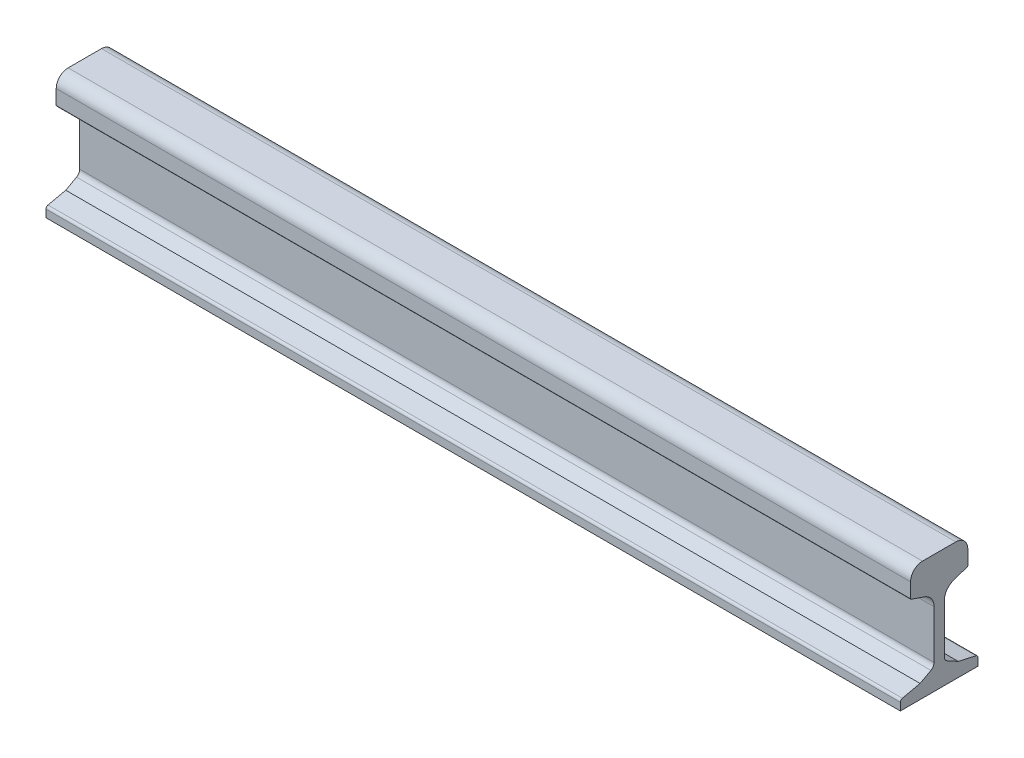
ISO-10303-21;
HEADER;
FILE_DESCRIPTION(('STEP AP214'),'2;1');
FILE_NAME('part.step','',(''),(''),'','','');
FILE_SCHEMA(('AUTOMOTIVE_DESIGN { 1 0 10303 214 1 1 1 1 }'));
ENDSEC;
DATA;
#1=APPLICATION_CONTEXT('core data for automotive mechanical design processes');
#2=APPLICATION_PROTOCOL_DEFINITION('international standard','automotive_design',2000,#1);
#3=PRODUCT_CONTEXT('',#1,'mechanical');
#4=PRODUCT('Part','Part','',(#3));
#5=PRODUCT_RELATED_PRODUCT_CATEGORY('part','',(#4));
#6=PRODUCT_DEFINITION_FORMATION('','',#4);
#7=PRODUCT_DEFINITION_CONTEXT('part definition',#1,'design');
#8=PRODUCT_DEFINITION('design','',#6,#7);
#9=PRODUCT_DEFINITION_SHAPE('','',#8);
#10=(LENGTH_UNIT() NAMED_UNIT(*) SI_UNIT(.MILLI.,.METRE.));
#11=(NAMED_UNIT(*) PLANE_ANGLE_UNIT() SI_UNIT($,.RADIAN.));
#12=(NAMED_UNIT(*) SI_UNIT($,.STERADIAN.) SOLID_ANGLE_UNIT());
#13=UNCERTAINTY_MEASURE_WITH_UNIT(LENGTH_MEASURE(1.E-05),#10,'distance_accuracy_value','');
#14=(GEOMETRIC_REPRESENTATION_CONTEXT(3) GLOBAL_UNCERTAINTY_ASSIGNED_CONTEXT((#13)) GLOBAL_UNIT_ASSIGNED_CONTEXT((#10,
#11,#12)) REPRESENTATION_CONTEXT('',''));
#15=CARTESIAN_POINT('',(0.,0.,0.));
#16=DIRECTION('',(0.,0.,1.));
#17=DIRECTION('',(1.,0.,0.));
#18=AXIS2_PLACEMENT_3D('',#15,#16,#17);
#19=CARTESIAN_POINT('',(500.,124.,19.5));
#20=DIRECTION('',(-1.,0.,0.));
#21=DIRECTION('',(0.,0.,1.));
#22=AXIS2_PLACEMENT_3D('',#19,#20,#21);
#23=CYLINDRICAL_SURFACE('',#22,14.);
#24=CARTESIAN_POINT('',(-500.,124.,19.5));
#25=DIRECTION('',(1.,0.,0.));
#26=DIRECTION('',(0.,0.,1.));
#27=AXIS2_PLACEMENT_3D('',#24,#25,#26);
#28=CIRCLE('',#27,14.);
#29=CARTESIAN_POINT('',(-500.,138.,19.5));
#30=VERTEX_POINT('',#29);
#31=CARTESIAN_POINT('',(-500.,124.,33.5));
#32=VERTEX_POINT('',#31);
#33=EDGE_CURVE('E229',#30,#32,#28,.T.);
#34=ORIENTED_EDGE('',*,*,#33,.T.);
#35=DIRECTION('',(-1.,0.,0.));
#36=VECTOR('',#35,1.);
#37=CARTESIAN_POINT('',(500.,124.,33.5));
#38=LINE('',#37,#36);
#39=CARTESIAN_POINT('',(500.,124.,33.5));
#40=VERTEX_POINT('',#39);
#41=EDGE_CURVE('E11',#40,#32,#38,.T.);
#42=ORIENTED_EDGE('',*,*,#41,.F.);
#43=CARTESIAN_POINT('',(500.,124.,19.5));
#44=DIRECTION('',(1.,0.,0.));
#45=DIRECTION('',(0.,0.,1.));
#46=AXIS2_PLACEMENT_3D('',#43,#44,#45);
#47=CIRCLE('',#46,14.);
#48=CARTESIAN_POINT('',(500.,138.,19.5));
#49=VERTEX_POINT('',#48);
#50=EDGE_CURVE('E275',#49,#40,#47,.T.);
#51=ORIENTED_EDGE('',*,*,#50,.F.);
#52=DIRECTION('',(-1.,0.,0.));
#53=VECTOR('',#52,1.);
#54=CARTESIAN_POINT('',(500.,138.,19.5));
#55=LINE('',#54,#53);
#56=EDGE_CURVE('E225',#49,#30,#55,.T.);
#57=ORIENTED_EDGE('',*,*,#56,.T.);
#58=EDGE_LOOP('',(#34,#42,#51,#57));
#59=FACE_BOUND('',#58,.T.);
#60=ADVANCED_FACE('F37',(#59),#23,.T.);
#61=CARTESIAN_POINT('',(500.,106.883096131922,33.5));
#62=DIRECTION('',(0.,0.,-1.));
#63=DIRECTION('',(0.,1.,0.));
#64=AXIS2_PLACEMENT_3D('',#61,#62,#63);
#65=PLANE('',#64);
#66=DIRECTION('',(0.,-1.,0.));
#67=VECTOR('',#66,1.);
#68=CARTESIAN_POINT('',(-500.,106.883096131922,33.5));
#69=LINE('',#68,#67);
#70=CARTESIAN_POINT('',(-500.,106.883096131922,33.5));
#71=VERTEX_POINT('',#70);
#72=EDGE_CURVE('E232',#32,#71,#69,.T.);
#73=ORIENTED_EDGE('',*,*,#72,.T.);
#74=DIRECTION('',(-1.,0.,0.));
#75=VECTOR('',#74,1.);
#76=CARTESIAN_POINT('',(500.,106.883096131922,33.5));
#77=LINE('',#76,#75);
#78=CARTESIAN_POINT('',(500.,106.883096131922,33.5));
#79=VERTEX_POINT('',#78);
#80=EDGE_CURVE('E45',#79,#71,#77,.T.);
#81=ORIENTED_EDGE('',*,*,#80,.F.);
#82=DIRECTION('',(0.,-1.,0.));
#83=VECTOR('',#82,1.);
#84=CARTESIAN_POINT('',(500.,106.883096131922,33.5));
#85=LINE('',#84,#83);
#86=EDGE_CURVE('E144',#40,#79,#85,.T.);
#87=ORIENTED_EDGE('',*,*,#86,.F.);
#88=ORIENTED_EDGE('',*,*,#41,.T.);
#89=EDGE_LOOP('',(#73,#81,#87,#88));
#90=FACE_BOUND('',#89,.T.);
#91=ADVANCED_FACE('F413',(#90),#65,.F.);
#92=CARTESIAN_POINT('',(500.,106.883096131922,32.5));
#93=DIRECTION('',(-1.,0.,0.));
#94=DIRECTION('',(0.,0.,1.));
#95=AXIS2_PLACEMENT_3D('',#92,#93,#94);
#96=CYLINDRICAL_SURFACE('',#95,0.999999999999971);
#97=CARTESIAN_POINT('',(-500.,106.883096131922,32.5));
#98=DIRECTION('',(1.,0.,0.));
#99=DIRECTION('',(0.,0.,1.));
#100=AXIS2_PLACEMENT_3D('',#97,#98,#99);
#101=CIRCLE('',#100,0.999999999999971);
#102=CARTESIAN_POINT('',(-500.,105.937662586695,32.8258149959097));
#103=VERTEX_POINT('',#102);
#104=EDGE_CURVE('E234',#71,#103,#101,.T.);
#105=ORIENTED_EDGE('',*,*,#104,.T.);
#106=DIRECTION('',(-1.,0.,0.));
#107=VECTOR('',#106,1.);
#108=CARTESIAN_POINT('',(500.,105.937662586695,32.8258149959097));
#109=LINE('',#108,#107);
#110=CARTESIAN_POINT('',(500.,105.937662586695,32.8258149959097));
#111=VERTEX_POINT('',#110);
#112=EDGE_CURVE('E330',#111,#103,#109,.T.);
#113=ORIENTED_EDGE('',*,*,#112,.F.);
#114=CARTESIAN_POINT('',(500.,106.883096131922,32.5));
#115=DIRECTION('',(1.,0.,0.));
#116=DIRECTION('',(0.,0.,1.));
#117=AXIS2_PLACEMENT_3D('',#114,#115,#116);
#118=CIRCLE('',#117,0.999999999999971);
#119=EDGE_CURVE('E338',#79,#111,#118,.T.);
#120=ORIENTED_EDGE('',*,*,#119,.F.);
#121=ORIENTED_EDGE('',*,*,#80,.T.);
#122=EDGE_LOOP('',(#105,#113,#120,#121));
#123=FACE_BOUND('',#122,.T.);
#124=ADVANCED_FACE('F336',(#123),#96,.T.);
#125=CARTESIAN_POINT('',(500.,100.703577083863,17.6378093022283));
#126=DIRECTION('',(0.,0.945433545226941,-0.325814995909669));
#127=DIRECTION('',(0.,0.325814995909669,0.945433545226941));
#128=AXIS2_PLACEMENT_3D('',#125,#126,#127);
#129=PLANE('',#128);
#130=DIRECTION('',(0.,-0.325814995909669,-0.945433545226941));
#131=VECTOR('',#130,1.);
#132=CARTESIAN_POINT('',(-500.,100.703577083863,17.6378093022283));
#133=LINE('',#132,#131);
#134=CARTESIAN_POINT('',(-500.,100.703577083863,17.6378093022283));
#135=VERTEX_POINT('',#134);
#136=EDGE_CURVE('E236',#103,#135,#133,.T.);
#137=ORIENTED_EDGE('',*,*,#136,.T.);
#138=DIRECTION('',(-1.,0.,0.));
#139=VECTOR('',#138,1.);
#140=CARTESIAN_POINT('',(500.,100.703577083863,17.6378093022283));
#141=LINE('',#140,#139);
#142=CARTESIAN_POINT('',(500.,100.703577083863,17.6378093022283));
#143=VERTEX_POINT('',#142);
#144=EDGE_CURVE('E327',#143,#135,#141,.T.);
#145=ORIENTED_EDGE('',*,*,#144,.F.);
#146=DIRECTION('',(0.,-0.325814995909669,-0.945433545226941));
#147=VECTOR('',#146,1.);
#148=CARTESIAN_POINT('',(500.,100.703577083863,17.6378093022283));
#149=LINE('',#148,#147);
#150=EDGE_CURVE('E356',#111,#143,#149,.T.);
#151=ORIENTED_EDGE('',*,*,#150,.F.);
#152=ORIENTED_EDGE('',*,*,#112,.T.);
#153=EDGE_LOOP('',(#137,#145,#151,#152));
#154=FACE_BOUND('',#153,.T.);
#155=ADVANCED_FACE('F347',(#154),#129,.F.);
#156=CARTESIAN_POINT('',(500.,85.0363368805743,22.3648076304894));
#157=DIRECTION('',(-1.,0.,0.));
#158=DIRECTION('',(0.,0.,1.));
#159=AXIS2_PLACEMENT_3D('',#156,#157,#158);
#160=CYLINDRICAL_SURFACE('',#159,16.3648076304896);
#161=CARTESIAN_POINT('',(-500.,85.0363368805743,22.3648076304894));
#162=DIRECTION('',(-1.,0.,0.));
#163=DIRECTION('',(0.,0.,-1.));
#164=AXIS2_PLACEMENT_3D('',#161,#162,#163);
#165=CIRCLE('',#164,16.3648076304896);
#166=CARTESIAN_POINT('',(-500.,85.0363368805743,5.99999999999979));
#167=VERTEX_POINT('',#166);
#168=EDGE_CURVE('E238',#135,#167,#165,.T.);
#169=ORIENTED_EDGE('',*,*,#168,.T.);
#170=DIRECTION('',(-1.,0.,0.));
#171=VECTOR('',#170,1.);
#172=CARTESIAN_POINT('',(500.,85.0363368805743,5.99999999999979));
#173=LINE('',#172,#171);
#174=CARTESIAN_POINT('',(500.,85.0363368805743,5.99999999999979));
#175=VERTEX_POINT('',#174);
#176=EDGE_CURVE('E324',#175,#167,#173,.T.);
#177=ORIENTED_EDGE('',*,*,#176,.F.);
#178=CARTESIAN_POINT('',(500.,85.0363368805743,22.3648076304894));
#179=DIRECTION('',(-1.,0.,0.));
#180=DIRECTION('',(0.,0.,-1.));
#181=AXIS2_PLACEMENT_3D('',#178,#179,#180);
#182=CIRCLE('',#181,16.3648076304896);
#183=EDGE_CURVE('E353',#143,#175,#182,.T.);
#184=ORIENTED_EDGE('',*,*,#183,.F.);
#185=ORIENTED_EDGE('',*,*,#144,.T.);
#186=EDGE_LOOP('',(#169,#177,#184,#185));
#187=FACE_BOUND('',#186,.T.);
#188=ADVANCED_FACE('F351',(#187),#160,.F.);
#189=CARTESIAN_POINT('',(500.,28.4505860304268,6.00000000000001));
#190=DIRECTION('',(0.,0.,-1.));
#191=DIRECTION('',(0.,1.,0.));
#192=AXIS2_PLACEMENT_3D('',#189,#190,#191);
#193=PLANE('',#192);
#194=DIRECTION('',(0.,-1.,0.));
#195=VECTOR('',#194,1.);
#196=CARTESIAN_POINT('',(-500.,28.4505860304268,6.00000000000001));
#197=LINE('',#196,#195);
#198=CARTESIAN_POINT('',(-500.,28.4505860304268,6.00000000000001));
#199=VERTEX_POINT('',#198);
#200=EDGE_CURVE('E240',#167,#199,#197,.T.);
#201=ORIENTED_EDGE('',*,*,#200,.T.);
#202=DIRECTION('',(-1.,0.,0.));
#203=VECTOR('',#202,1.);
#204=CARTESIAN_POINT('',(500.,28.4505860304268,6.00000000000001));
#205=LINE('',#204,#203);
#206=CARTESIAN_POINT('',(500.,28.4505860304268,6.00000000000001));
#207=VERTEX_POINT('',#206);
#208=EDGE_CURVE('E321',#207,#199,#205,.T.);
#209=ORIENTED_EDGE('',*,*,#208,.F.);
#210=DIRECTION('',(0.,-1.,0.));
#211=VECTOR('',#210,1.);
#212=CARTESIAN_POINT('',(500.,28.4505860304268,6.00000000000001));
#213=LINE('',#212,#211);
#214=EDGE_CURVE('E355',#175,#207,#213,.T.);
#215=ORIENTED_EDGE('',*,*,#214,.F.);
#216=ORIENTED_EDGE('',*,*,#176,.T.);
#217=EDGE_LOOP('',(#201,#209,#215,#216));
#218=FACE_BOUND('',#217,.T.);
#219=ADVANCED_FACE('F426',(#218),#193,.F.);
#220=CARTESIAN_POINT('',(500.,28.4505860304268,13.));
#221=DIRECTION('',(-1.,0.,0.));
#222=DIRECTION('',(0.,0.,1.));
#223=AXIS2_PLACEMENT_3D('',#220,#221,#222);
#224=CYLINDRICAL_SURFACE('',#223,6.99999999999999);
#225=CARTESIAN_POINT('',(-500.,28.4505860304268,13.));
#226=DIRECTION('',(-1.,0.,0.));
#227=DIRECTION('',(0.,0.,-1.));
#228=AXIS2_PLACEMENT_3D('',#225,#226,#227);
#229=CIRCLE('',#228,6.99999999999999);
#230=CARTESIAN_POINT('',(-500.,22.2998038741974,9.65816235184747));
#231=VERTEX_POINT('',#230);
#232=EDGE_CURVE('E242',#199,#231,#229,.T.);
#233=ORIENTED_EDGE('',*,*,#232,.T.);
#234=DIRECTION('',(-1.,0.,0.));
#235=VECTOR('',#234,1.);
#236=CARTESIAN_POINT('',(500.,22.2998038741974,9.65816235184747));
#237=LINE('',#236,#235);
#238=CARTESIAN_POINT('',(500.,22.2998038741974,9.65816235184747));
#239=VERTEX_POINT('',#238);
#240=EDGE_CURVE('E318',#239,#231,#237,.T.);
#241=ORIENTED_EDGE('',*,*,#240,.F.);
#242=CARTESIAN_POINT('',(500.,28.4505860304268,13.));
#243=DIRECTION('',(-1.,0.,0.));
#244=DIRECTION('',(0.,0.,-1.));
#245=AXIS2_PLACEMENT_3D('',#242,#243,#244);
#246=CIRCLE('',#245,6.99999999999999);
#247=EDGE_CURVE('E358',#207,#239,#246,.T.);
#248=ORIENTED_EDGE('',*,*,#247,.F.);
#249=ORIENTED_EDGE('',*,*,#208,.T.);
#250=EDGE_LOOP('',(#233,#241,#248,#249));
#251=FACE_BOUND('',#250,.T.);
#252=ADVANCED_FACE('F429',(#251),#224,.F.);
#253=CARTESIAN_POINT('',(500.,15.3960403372497,22.3648076304894));
#254=DIRECTION('',(0.,-0.878683165175633,-0.477405378307505));
#255=DIRECTION('',(0.,0.477405378307505,-0.878683165175633));
#256=AXIS2_PLACEMENT_3D('',#253,#254,#255);
#257=PLANE('',#256);
#258=DIRECTION('',(0.,-0.477405378307505,0.878683165175633));
#259=VECTOR('',#258,1.);
#260=CARTESIAN_POINT('',(-500.,15.3960403372497,22.3648076304894));
#261=LINE('',#260,#259);
#262=CARTESIAN_POINT('',(-500.,15.3960403372497,22.3648076304894));
#263=VERTEX_POINT('',#262);
#264=EDGE_CURVE('E244',#231,#263,#261,.T.);
#265=ORIENTED_EDGE('',*,*,#264,.T.);
#266=DIRECTION('',(-1.,0.,0.));
#267=VECTOR('',#266,1.);
#268=CARTESIAN_POINT('',(500.,15.3960403372497,22.3648076304894));
#269=LINE('',#268,#267);
#270=CARTESIAN_POINT('',(500.,15.3960403372497,22.3648076304894));
#271=VERTEX_POINT('',#270);
#272=EDGE_CURVE('E315',#271,#263,#269,.T.);
#273=ORIENTED_EDGE('',*,*,#272,.F.);
#274=DIRECTION('',(0.,-0.477405378307505,0.878683165175633));
#275=VECTOR('',#274,1.);
#276=CARTESIAN_POINT('',(500.,15.3960403372497,22.3648076304894));
#277=LINE('',#276,#275);
#278=EDGE_CURVE('E364',#239,#271,#277,.T.);
#279=ORIENTED_EDGE('',*,*,#278,.F.);
#280=ORIENTED_EDGE('',*,*,#240,.T.);
#281=EDGE_LOOP('',(#265,#273,#279,#280));
#282=FACE_BOUND('',#281,.T.);
#283=ADVANCED_FACE('F433',(#282),#257,.F.);
#284=CARTESIAN_POINT('',(500.,10.7564644209935,43.1114569922355));
#285=DIRECTION('',(0.,-0.975895223445728,-0.218239576740363));
#286=DIRECTION('',(0.,0.218239576740363,-0.975895223445728));
#287=AXIS2_PLACEMENT_3D('',#284,#285,#286);
#288=PLANE('',#287);
#289=DIRECTION('',(0.,-0.218239576740363,0.975895223445728));
#290=VECTOR('',#289,1.);
#291=CARTESIAN_POINT('',(-500.,10.7564644209935,43.1114569922355));
#292=LINE('',#291,#290);
#293=CARTESIAN_POINT('',(-500.,10.7564644209935,43.1114569922355));
#294=VERTEX_POINT('',#293);
#295=EDGE_CURVE('E246',#263,#294,#292,.T.);
#296=ORIENTED_EDGE('',*,*,#295,.T.);
#297=DIRECTION('',(-1.,0.,0.));
#298=VECTOR('',#297,1.);
#299=CARTESIAN_POINT('',(500.,10.7564644209935,43.1114569922355));
#300=LINE('',#299,#298);
#301=CARTESIAN_POINT('',(500.,10.7564644209935,43.1114569922355));
#302=VERTEX_POINT('',#301);
#303=EDGE_CURVE('E312',#302,#294,#300,.T.);
#304=ORIENTED_EDGE('',*,*,#303,.F.);
#305=DIRECTION('',(0.,-0.218239576740363,0.975895223445728));
#306=VECTOR('',#305,1.);
#307=CARTESIAN_POINT('',(500.,10.7564644209935,43.1114569922355));
#308=LINE('',#307,#306);
#309=EDGE_CURVE('E366',#271,#302,#308,.T.);
#310=ORIENTED_EDGE('',*,*,#309,.F.);
#311=ORIENTED_EDGE('',*,*,#272,.T.);
#312=EDGE_LOOP('',(#296,#304,#310,#311));
#313=FACE_BOUND('',#312,.T.);
#314=ADVANCED_FACE('F437',(#313),#288,.F.);
#315=CARTESIAN_POINT('',(500.,7.82877875065634,42.4567382620145));
#316=DIRECTION('',(-1.,0.,0.));
#317=DIRECTION('',(0.,0.,1.));
#318=AXIS2_PLACEMENT_3D('',#315,#316,#317);
#319=CYLINDRICAL_SURFACE('',#318,3.00000000000001);
#320=CARTESIAN_POINT('',(-500.,7.82877875065634,42.4567382620145));
#321=DIRECTION('',(1.,0.,0.));
#322=DIRECTION('',(0.,0.,1.));
#323=AXIS2_PLACEMENT_3D('',#320,#321,#322);
#324=CIRCLE('',#323,3.00000000000001);
#325=CARTESIAN_POINT('',(-500.,7.82877875065634,45.4567382620145));
#326=VERTEX_POINT('',#325);
#327=EDGE_CURVE('E248',#294,#326,#324,.T.);
#328=ORIENTED_EDGE('',*,*,#327,.T.);
#329=DIRECTION('',(-1.,0.,0.));
#330=VECTOR('',#329,1.);
#331=CARTESIAN_POINT('',(500.,7.82877875065634,45.4567382620145));
#332=LINE('',#331,#330);
#333=CARTESIAN_POINT('',(500.,7.82877875065634,45.4567382620145));
#334=VERTEX_POINT('',#333);
#335=EDGE_CURVE('E309',#334,#326,#332,.T.);
#336=ORIENTED_EDGE('',*,*,#335,.F.);
#337=CARTESIAN_POINT('',(500.,7.82877875065634,42.4567382620145));
#338=DIRECTION('',(1.,0.,0.));
#339=DIRECTION('',(0.,0.,1.));
#340=AXIS2_PLACEMENT_3D('',#337,#338,#339);
#341=CIRCLE('',#340,3.00000000000001);
#342=EDGE_CURVE('E368',#302,#334,#341,.T.);
#343=ORIENTED_EDGE('',*,*,#342,.F.);
#344=ORIENTED_EDGE('',*,*,#303,.T.);
#345=EDGE_LOOP('',(#328,#336,#343,#344));
#346=FACE_BOUND('',#345,.T.);
#347=ADVANCED_FACE('F441',(#346),#319,.T.);
#348=CARTESIAN_POINT('',(500.,-1.01353557900647,45.4567382620144));
#349=DIRECTION('',(0.,0.,-1.));
#350=DIRECTION('',(0.,1.,0.));
#351=AXIS2_PLACEMENT_3D('',#348,#349,#350);
#352=PLANE('',#351);
#353=DIRECTION('',(0.,-1.,0.));
#354=VECTOR('',#353,1.);
#355=CARTESIAN_POINT('',(-500.,-1.01353557900647,45.4567382620144));
#356=LINE('',#355,#354);
#357=CARTESIAN_POINT('',(-500.,-1.01353557900647,45.4567382620144));
#358=VERTEX_POINT('',#357);
#359=EDGE_CURVE('E250',#326,#358,#356,.T.);
#360=ORIENTED_EDGE('',*,*,#359,.T.);
#361=DIRECTION('',(-1.,0.,0.));
#362=VECTOR('',#361,1.);
#363=CARTESIAN_POINT('',(500.,-1.01353557900647,45.4567382620144));
#364=LINE('',#363,#362);
#365=CARTESIAN_POINT('',(500.,-1.01353557900647,45.4567382620144));
#366=VERTEX_POINT('',#365);
#367=EDGE_CURVE('E306',#366,#358,#364,.T.);
#368=ORIENTED_EDGE('',*,*,#367,.F.);
#369=DIRECTION('',(0.,-1.,0.));
#370=VECTOR('',#369,1.);
#371=CARTESIAN_POINT('',(500.,-1.01353557900647,45.4567382620144));
#372=LINE('',#371,#370);
#373=EDGE_CURVE('E370',#334,#366,#372,.T.);
#374=ORIENTED_EDGE('',*,*,#373,.F.);
#375=ORIENTED_EDGE('',*,*,#335,.T.);
#376=EDGE_LOOP('',(#360,#368,#374,#375));
#377=FACE_BOUND('',#376,.T.);
#378=ADVANCED_FACE('F445',(#377),#352,.F.);
#379=CARTESIAN_POINT('',(500.,-1.01353557900647,45.4567382620144));
#380=DIRECTION('',(0.,1.,0.));
#381=DIRECTION('',(0.,0.,1.));
#382=AXIS2_PLACEMENT_3D('',#379,#380,#381);
#383=PLANE('',#382);
#384=DIRECTION('',(0.,0.,-1.));
#385=VECTOR('',#384,1.);
#386=CARTESIAN_POINT('',(-500.,-1.01353557900647,45.4567382620144));
#387=LINE('',#386,#385);
#388=CARTESIAN_POINT('',(-500.,-1.01353557900647,-45.4567382620144));
#389=VERTEX_POINT('',#388);
#390=EDGE_CURVE('E252',#358,#389,#387,.T.);
#391=ORIENTED_EDGE('',*,*,#390,.T.);
#392=DIRECTION('',(-1.,0.,0.));
#393=VECTOR('',#392,1.);
#394=CARTESIAN_POINT('',(500.,-1.01353557900647,-45.4567382620144));
#395=LINE('',#394,#393);
#396=CARTESIAN_POINT('',(500.,-1.01353557900647,-45.4567382620144));
#397=VERTEX_POINT('',#396);
#398=EDGE_CURVE('E303',#397,#389,#395,.T.);
#399=ORIENTED_EDGE('',*,*,#398,.F.);
#400=DIRECTION('',(0.,0.,-1.));
#401=VECTOR('',#400,1.);
#402=CARTESIAN_POINT('',(500.,-1.01353557900647,45.4567382620144));
#403=LINE('',#402,#401);
#404=EDGE_CURVE('E372',#366,#397,#403,.T.);
#405=ORIENTED_EDGE('',*,*,#404,.F.);
#406=ORIENTED_EDGE('',*,*,#367,.T.);
#407=EDGE_LOOP('',(#391,#399,#405,#406));
#408=FACE_BOUND('',#407,.T.);
#409=ADVANCED_FACE('F449',(#408),#383,.F.);
#410=CARTESIAN_POINT('',(500.,-1.01353557900647,-45.4567382620144));
#411=DIRECTION('',(0.,0.,1.));
#412=DIRECTION('',(0.,-1.,0.));
#413=AXIS2_PLACEMENT_3D('',#410,#411,#412);
#414=PLANE('',#413);
#415=DIRECTION('',(0.,1.,0.));
#416=VECTOR('',#415,1.);
#417=CARTESIAN_POINT('',(-500.,-1.01353557900647,-45.4567382620144));
#418=LINE('',#417,#416);
#419=CARTESIAN_POINT('',(-500.,7.82877875065634,-45.4567382620145));
#420=VERTEX_POINT('',#419);
#421=EDGE_CURVE('E254',#389,#420,#418,.T.);
#422=ORIENTED_EDGE('',*,*,#421,.T.);
#423=DIRECTION('',(-1.,0.,0.));
#424=VECTOR('',#423,1.);
#425=CARTESIAN_POINT('',(500.,7.82877875065634,-45.4567382620145));
#426=LINE('',#425,#424);
#427=CARTESIAN_POINT('',(500.,7.82877875065634,-45.4567382620145));
#428=VERTEX_POINT('',#427);
#429=EDGE_CURVE('E300',#428,#420,#426,.T.);
#430=ORIENTED_EDGE('',*,*,#429,.F.);
#431=DIRECTION('',(0.,1.,0.));
#432=VECTOR('',#431,1.);
#433=CARTESIAN_POINT('',(500.,-1.01353557900647,-45.4567382620144));
#434=LINE('',#433,#432);
#435=EDGE_CURVE('E374',#397,#428,#434,.T.);
#436=ORIENTED_EDGE('',*,*,#435,.F.);
#437=ORIENTED_EDGE('',*,*,#398,.T.);
#438=EDGE_LOOP('',(#422,#430,#436,#437));
#439=FACE_BOUND('',#438,.T.);
#440=ADVANCED_FACE('F453',(#439),#414,.F.);
#441=CARTESIAN_POINT('',(500.,7.82877875065634,-42.4567382620145));
#442=DIRECTION('',(-1.,0.,0.));
#443=DIRECTION('',(0.,0.,1.));
#444=AXIS2_PLACEMENT_3D('',#441,#442,#443);
#445=CYLINDRICAL_SURFACE('',#444,3.00000000000001);
#446=CARTESIAN_POINT('',(-500.,7.82877875065634,-42.4567382620145));
#447=DIRECTION('',(1.,0.,0.));
#448=DIRECTION('',(0.,0.,-1.));
#449=AXIS2_PLACEMENT_3D('',#446,#447,#448);
#450=CIRCLE('',#449,3.00000000000001);
#451=CARTESIAN_POINT('',(-500.,10.7564644209935,-43.1114569922355));
#452=VERTEX_POINT('',#451);
#453=EDGE_CURVE('E256',#420,#452,#450,.T.);
#454=ORIENTED_EDGE('',*,*,#453,.T.);
#455=DIRECTION('',(-1.,0.,0.));
#456=VECTOR('',#455,1.);
#457=CARTESIAN_POINT('',(500.,10.7564644209935,-43.1114569922355));
#458=LINE('',#457,#456);
#459=CARTESIAN_POINT('',(500.,10.7564644209935,-43.1114569922355));
#460=VERTEX_POINT('',#459);
#461=EDGE_CURVE('E297',#460,#452,#458,.T.);
#462=ORIENTED_EDGE('',*,*,#461,.F.);
#463=CARTESIAN_POINT('',(500.,7.82877875065634,-42.4567382620145));
#464=DIRECTION('',(1.,0.,0.));
#465=DIRECTION('',(0.,0.,-1.));
#466=AXIS2_PLACEMENT_3D('',#463,#464,#465);
#467=CIRCLE('',#466,3.00000000000001);
#468=EDGE_CURVE('E376',#428,#460,#467,.T.);
#469=ORIENTED_EDGE('',*,*,#468,.F.);
#470=ORIENTED_EDGE('',*,*,#429,.T.);
#471=EDGE_LOOP('',(#454,#462,#469,#470));
#472=FACE_BOUND('',#471,.T.);
#473=ADVANCED_FACE('F457',(#472),#445,.T.);
#474=CARTESIAN_POINT('',(500.,10.7564644209935,-43.1114569922355));
#475=DIRECTION('',(0.,-0.975895223445728,0.218239576740362));
#476=DIRECTION('',(0.,-0.218239576740362,-0.975895223445728));
#477=AXIS2_PLACEMENT_3D('',#474,#475,#476);
#478=PLANE('',#477);
#479=DIRECTION('',(0.,0.218239576740362,0.975895223445728));
#480=VECTOR('',#479,1.);
#481=CARTESIAN_POINT('',(-500.,10.7564644209935,-43.1114569922355));
#482=LINE('',#481,#480);
#483=CARTESIAN_POINT('',(-500.,15.3960403372496,-22.3648076304894));
#484=VERTEX_POINT('',#483);
#485=EDGE_CURVE('E258',#452,#484,#482,.T.);
#486=ORIENTED_EDGE('',*,*,#485,.T.);
#487=DIRECTION('',(-1.,0.,0.));
#488=VECTOR('',#487,1.);
#489=CARTESIAN_POINT('',(500.,15.3960403372496,-22.3648076304894));
#490=LINE('',#489,#488);
#491=CARTESIAN_POINT('',(500.,15.3960403372496,-22.3648076304894));
#492=VERTEX_POINT('',#491);
#493=EDGE_CURVE('E294',#492,#484,#490,.T.);
#494=ORIENTED_EDGE('',*,*,#493,.F.);
#495=DIRECTION('',(0.,0.218239576740362,0.975895223445728));
#496=VECTOR('',#495,1.);
#497=CARTESIAN_POINT('',(500.,10.7564644209935,-43.1114569922355));
#498=LINE('',#497,#496);
#499=EDGE_CURVE('E378',#460,#492,#498,.T.);
#500=ORIENTED_EDGE('',*,*,#499,.F.);
#501=ORIENTED_EDGE('',*,*,#461,.T.);
#502=EDGE_LOOP('',(#486,#494,#500,#501));
#503=FACE_BOUND('',#502,.T.);
#504=ADVANCED_FACE('F461',(#503),#478,.F.);
#505=CARTESIAN_POINT('',(500.,15.3960403372496,-22.3648076304894));
#506=DIRECTION('',(0.,-0.878683165175632,0.477405378307506));
#507=DIRECTION('',(0.,-0.477405378307506,-0.878683165175632));
#508=AXIS2_PLACEMENT_3D('',#505,#506,#507);
#509=PLANE('',#508);
#510=DIRECTION('',(0.,0.477405378307506,0.878683165175632));
#511=VECTOR('',#510,1.);
#512=CARTESIAN_POINT('',(-500.,15.3960403372496,-22.3648076304894));
#513=LINE('',#512,#511);
#514=CARTESIAN_POINT('',(-500.,22.2998038741974,-9.65816235184748));
#515=VERTEX_POINT('',#514);
#516=EDGE_CURVE('E260',#484,#515,#513,.T.);
#517=ORIENTED_EDGE('',*,*,#516,.T.);
#518=DIRECTION('',(-1.,0.,0.));
#519=VECTOR('',#518,1.);
#520=CARTESIAN_POINT('',(500.,22.2998038741974,-9.65816235184748));
#521=LINE('',#520,#519);
#522=CARTESIAN_POINT('',(500.,22.2998038741974,-9.65816235184748));
#523=VERTEX_POINT('',#522);
#524=EDGE_CURVE('E291',#523,#515,#521,.T.);
#525=ORIENTED_EDGE('',*,*,#524,.F.);
#526=DIRECTION('',(0.,0.477405378307506,0.878683165175632));
#527=VECTOR('',#526,1.);
#528=CARTESIAN_POINT('',(500.,15.3960403372496,-22.3648076304894));
#529=LINE('',#528,#527);
#530=EDGE_CURVE('E380',#492,#523,#529,.T.);
#531=ORIENTED_EDGE('',*,*,#530,.F.);
#532=ORIENTED_EDGE('',*,*,#493,.T.);
#533=EDGE_LOOP('',(#517,#525,#531,#532));
#534=FACE_BOUND('',#533,.T.);
#535=ADVANCED_FACE('F465',(#534),#509,.F.);
#536=CARTESIAN_POINT('',(500.,28.4505860304268,-13.));
#537=DIRECTION('',(-1.,0.,0.));
#538=DIRECTION('',(0.,0.,1.));
#539=AXIS2_PLACEMENT_3D('',#536,#537,#538);
#540=CYLINDRICAL_SURFACE('',#539,6.99999999999999);
#541=CARTESIAN_POINT('',(-500.,28.4505860304268,-13.));
#542=DIRECTION('',(-1.,0.,0.));
#543=DIRECTION('',(0.,0.,1.));
#544=AXIS2_PLACEMENT_3D('',#541,#542,#543);
#545=CIRCLE('',#544,6.99999999999999);
#546=CARTESIAN_POINT('',(-500.,28.4505860304268,-6.00000000000002));
#547=VERTEX_POINT('',#546);
#548=EDGE_CURVE('E262',#515,#547,#545,.T.);
#549=ORIENTED_EDGE('',*,*,#548,.T.);
#550=DIRECTION('',(-1.,0.,0.));
#551=VECTOR('',#550,1.);
#552=CARTESIAN_POINT('',(500.,28.4505860304268,-6.00000000000002));
#553=LINE('',#552,#551);
#554=CARTESIAN_POINT('',(500.,28.4505860304268,-6.00000000000002));
#555=VERTEX_POINT('',#554);
#556=EDGE_CURVE('E288',#555,#547,#553,.T.);
#557=ORIENTED_EDGE('',*,*,#556,.F.);
#558=CARTESIAN_POINT('',(500.,28.4505860304268,-13.));
#559=DIRECTION('',(-1.,0.,0.));
#560=DIRECTION('',(0.,0.,1.));
#561=AXIS2_PLACEMENT_3D('',#558,#559,#560);
#562=CIRCLE('',#561,6.99999999999999);
#563=EDGE_CURVE('E382',#523,#555,#562,.T.);
#564=ORIENTED_EDGE('',*,*,#563,.F.);
#565=ORIENTED_EDGE('',*,*,#524,.T.);
#566=EDGE_LOOP('',(#549,#557,#564,#565));
#567=FACE_BOUND('',#566,.T.);
#568=ADVANCED_FACE('F469',(#567),#540,.F.);
#569=CARTESIAN_POINT('',(500.,28.4505860304268,-6.00000000000001));
#570=DIRECTION('',(0.,0.,1.));
#571=DIRECTION('',(0.,-1.,0.));
#572=AXIS2_PLACEMENT_3D('',#569,#570,#571);
#573=PLANE('',#572);
#574=DIRECTION('',(0.,1.,0.));
#575=VECTOR('',#574,1.);
#576=CARTESIAN_POINT('',(-500.,28.4505860304268,-6.00000000000001));
#577=LINE('',#576,#575);
#578=CARTESIAN_POINT('',(-500.,85.0363368805743,-6.00000000000001));
#579=VERTEX_POINT('',#578);
#580=EDGE_CURVE('E264',#547,#579,#577,.T.);
#581=ORIENTED_EDGE('',*,*,#580,.T.);
#582=DIRECTION('',(-1.,0.,0.));
#583=VECTOR('',#582,1.);
#584=CARTESIAN_POINT('',(500.,85.0363368805743,-6.00000000000001));
#585=LINE('',#584,#583);
#586=CARTESIAN_POINT('',(500.,85.0363368805743,-6.00000000000001));
#587=VERTEX_POINT('',#586);
#588=EDGE_CURVE('E285',#587,#579,#585,.T.);
#589=ORIENTED_EDGE('',*,*,#588,.F.);
#590=DIRECTION('',(0.,1.,0.));
#591=VECTOR('',#590,1.);
#592=CARTESIAN_POINT('',(500.,28.4505860304268,-6.00000000000001));
#593=LINE('',#592,#591);
#594=EDGE_CURVE('E384',#555,#587,#593,.T.);
#595=ORIENTED_EDGE('',*,*,#594,.F.);
#596=ORIENTED_EDGE('',*,*,#556,.T.);
#597=EDGE_LOOP('',(#581,#589,#595,#596));
#598=FACE_BOUND('',#597,.T.);
#599=ADVANCED_FACE('F473',(#598),#573,.F.);
#600=CARTESIAN_POINT('',(500.,85.0363368805743,-22.3648076304894));
#601=DIRECTION('',(-1.,0.,0.));
#602=DIRECTION('',(0.,0.,1.));
#603=AXIS2_PLACEMENT_3D('',#600,#601,#602);
#604=CYLINDRICAL_SURFACE('',#603,16.3648076304894);
#605=CARTESIAN_POINT('',(-500.,85.0363368805743,-22.3648076304894));
#606=DIRECTION('',(-1.,0.,0.));
#607=DIRECTION('',(0.,0.,1.));
#608=AXIS2_PLACEMENT_3D('',#605,#606,#607);
#609=CIRCLE('',#608,16.3648076304894);
#610=CARTESIAN_POINT('',(-500.,100.703577083863,-17.6378093022279));
#611=VERTEX_POINT('',#610);
#612=EDGE_CURVE('E266',#579,#611,#609,.T.);
#613=ORIENTED_EDGE('',*,*,#612,.T.);
#614=DIRECTION('',(-1.,0.,0.));
#615=VECTOR('',#614,1.);
#616=CARTESIAN_POINT('',(500.,100.703577083863,-17.6378093022279));
#617=LINE('',#616,#615);
#618=CARTESIAN_POINT('',(500.,100.703577083863,-17.6378093022279));
#619=VERTEX_POINT('',#618);
#620=EDGE_CURVE('E282',#619,#611,#617,.T.);
#621=ORIENTED_EDGE('',*,*,#620,.F.);
#622=CARTESIAN_POINT('',(500.,85.0363368805743,-22.3648076304894));
#623=DIRECTION('',(-1.,0.,0.));
#624=DIRECTION('',(0.,0.,1.));
#625=AXIS2_PLACEMENT_3D('',#622,#623,#624);
#626=CIRCLE('',#625,16.3648076304894);
#627=EDGE_CURVE('E386',#587,#619,#626,.T.);
#628=ORIENTED_EDGE('',*,*,#627,.F.);
#629=ORIENTED_EDGE('',*,*,#588,.T.);
#630=EDGE_LOOP('',(#613,#621,#628,#629));
#631=FACE_BOUND('',#630,.T.);
#632=ADVANCED_FACE('F477',(#631),#604,.F.);
#633=CARTESIAN_POINT('',(500.,100.703577083863,-17.6378093022279));
#634=DIRECTION('',(0.,0.945433545226933,0.325814995909694));
#635=DIRECTION('',(0.,-0.325814995909694,0.945433545226933));
#636=AXIS2_PLACEMENT_3D('',#633,#634,#635);
#637=PLANE('',#636);
#638=DIRECTION('',(0.,0.325814995909694,-0.945433545226933));
#639=VECTOR('',#638,1.);
#640=CARTESIAN_POINT('',(-500.,100.703577083863,-17.6378093022279));
#641=LINE('',#640,#639);
#642=CARTESIAN_POINT('',(-500.,105.937662586695,-32.8258149959097));
#643=VERTEX_POINT('',#642);
#644=EDGE_CURVE('E268',#611,#643,#641,.T.);
#645=ORIENTED_EDGE('',*,*,#644,.T.);
#646=DIRECTION('',(-1.,0.,0.));
#647=VECTOR('',#646,1.);
#648=CARTESIAN_POINT('',(500.,105.937662586695,-32.8258149959097));
#649=LINE('',#648,#647);
#650=CARTESIAN_POINT('',(500.,105.937662586695,-32.8258149959097));
#651=VERTEX_POINT('',#650);
#652=EDGE_CURVE('E279',#651,#643,#649,.T.);
#653=ORIENTED_EDGE('',*,*,#652,.F.);
#654=DIRECTION('',(0.,0.325814995909694,-0.945433545226933));
#655=VECTOR('',#654,1.);
#656=CARTESIAN_POINT('',(500.,100.703577083863,-17.6378093022279));
#657=LINE('',#656,#655);
#658=EDGE_CURVE('E388',#619,#651,#657,.T.);
#659=ORIENTED_EDGE('',*,*,#658,.F.);
#660=ORIENTED_EDGE('',*,*,#620,.T.);
#661=EDGE_LOOP('',(#645,#653,#659,#660));
#662=FACE_BOUND('',#661,.T.);
#663=ADVANCED_FACE('F394',(#662),#637,.F.);
#664=CARTESIAN_POINT('',(500.,106.883096131922,-32.5));
#665=DIRECTION('',(-1.,0.,0.));
#666=DIRECTION('',(0.,0.,1.));
#667=AXIS2_PLACEMENT_3D('',#664,#665,#666);
#668=CYLINDRICAL_SURFACE('',#667,1.);
#669=CARTESIAN_POINT('',(-500.,106.883096131922,-32.5));
#670=DIRECTION('',(1.,0.,0.));
#671=DIRECTION('',(0.,0.,-1.));
#672=AXIS2_PLACEMENT_3D('',#669,#670,#671);
#673=CIRCLE('',#672,1.);
#674=CARTESIAN_POINT('',(-500.,106.883096131922,-33.5));
#675=VERTEX_POINT('',#674);
#676=EDGE_CURVE('E270',#643,#675,#673,.T.);
#677=ORIENTED_EDGE('',*,*,#676,.T.);
#678=DIRECTION('',(-1.,0.,0.));
#679=VECTOR('',#678,1.);
#680=CARTESIAN_POINT('',(500.,106.883096131922,-33.5));
#681=LINE('',#680,#679);
#682=CARTESIAN_POINT('',(500.,106.883096131922,-33.5));
#683=VERTEX_POINT('',#682);
#684=EDGE_CURVE('E220',#683,#675,#681,.T.);
#685=ORIENTED_EDGE('',*,*,#684,.F.);
#686=CARTESIAN_POINT('',(500.,106.883096131922,-32.5));
#687=DIRECTION('',(1.,0.,0.));
#688=DIRECTION('',(0.,0.,-1.));
#689=AXIS2_PLACEMENT_3D('',#686,#687,#688);
#690=CIRCLE('',#689,1.);
#691=EDGE_CURVE('E211',#651,#683,#690,.T.);
#692=ORIENTED_EDGE('',*,*,#691,.F.);
#693=ORIENTED_EDGE('',*,*,#652,.T.);
#694=EDGE_LOOP('',(#677,#685,#692,#693));
#695=FACE_BOUND('',#694,.T.);
#696=ADVANCED_FACE('F398',(#695),#668,.T.);
#697=CARTESIAN_POINT('',(500.,106.883096131922,-33.5));
#698=DIRECTION('',(0.,0.,1.));
#699=DIRECTION('',(0.,-1.,0.));
#700=AXIS2_PLACEMENT_3D('',#697,#698,#699);
#701=PLANE('',#700);
#702=DIRECTION('',(0.,1.,0.));
#703=VECTOR('',#702,1.);
#704=CARTESIAN_POINT('',(-500.,106.883096131922,-33.5));
#705=LINE('',#704,#703);
#706=CARTESIAN_POINT('',(-500.,124.,-33.5));
#707=VERTEX_POINT('',#706);
#708=EDGE_CURVE('E219',#675,#707,#705,.T.);
#709=ORIENTED_EDGE('',*,*,#708,.T.);
#710=DIRECTION('',(-1.,0.,0.));
#711=VECTOR('',#710,1.);
#712=CARTESIAN_POINT('',(500.,124.,-33.5));
#713=LINE('',#712,#711);
#714=CARTESIAN_POINT('',(500.,124.,-33.5));
#715=VERTEX_POINT('',#714);
#716=EDGE_CURVE('E216',#715,#707,#713,.T.);
#717=ORIENTED_EDGE('',*,*,#716,.F.);
#718=DIRECTION('',(0.,1.,0.));
#719=VECTOR('',#718,1.);
#720=CARTESIAN_POINT('',(500.,106.883096131922,-33.5));
#721=LINE('',#720,#719);
#722=EDGE_CURVE('E205',#683,#715,#721,.T.);
#723=ORIENTED_EDGE('',*,*,#722,.F.);
#724=ORIENTED_EDGE('',*,*,#684,.T.);
#725=EDGE_LOOP('',(#709,#717,#723,#724));
#726=FACE_BOUND('',#725,.T.);
#727=ADVANCED_FACE('F217',(#726),#701,.F.);
#728=CARTESIAN_POINT('',(500.,124.,-19.5));
#729=DIRECTION('',(-1.,0.,0.));
#730=DIRECTION('',(0.,0.,1.));
#731=AXIS2_PLACEMENT_3D('',#728,#729,#730);
#732=CYLINDRICAL_SURFACE('',#731,14.);
#733=CARTESIAN_POINT('',(-500.,124.,-19.5));
#734=DIRECTION('',(1.,0.,0.));
#735=DIRECTION('',(0.,0.,-1.));
#736=AXIS2_PLACEMENT_3D('',#733,#734,#735);
#737=CIRCLE('',#736,14.);
#738=CARTESIAN_POINT('',(-500.,138.,-19.5));
#739=VERTEX_POINT('',#738);
#740=EDGE_CURVE('E130',#707,#739,#737,.T.);
#741=ORIENTED_EDGE('',*,*,#740,.T.);
#742=DIRECTION('',(-1.,0.,0.));
#743=VECTOR('',#742,1.);
#744=CARTESIAN_POINT('',(500.,138.,-19.5));
#745=LINE('',#744,#743);
#746=CARTESIAN_POINT('',(500.,138.,-19.5));
#747=VERTEX_POINT('',#746);
#748=EDGE_CURVE('E221',#747,#739,#745,.T.);
#749=ORIENTED_EDGE('',*,*,#748,.F.);
#750=CARTESIAN_POINT('',(500.,124.,-19.5));
#751=DIRECTION('',(1.,0.,0.));
#752=DIRECTION('',(0.,0.,-1.));
#753=AXIS2_PLACEMENT_3D('',#750,#751,#752);
#754=CIRCLE('',#753,14.);
#755=EDGE_CURVE('E209',#715,#747,#754,.T.);
#756=ORIENTED_EDGE('',*,*,#755,.F.);
#757=ORIENTED_EDGE('',*,*,#716,.T.);
#758=EDGE_LOOP('',(#741,#749,#756,#757));
#759=FACE_BOUND('',#758,.T.);
#760=ADVANCED_FACE('F223',(#759),#732,.T.);
#761=CARTESIAN_POINT('',(500.,138.,-19.5));
#762=DIRECTION('',(0.,-1.,0.));
#763=DIRECTION('',(0.,0.,-1.));
#764=AXIS2_PLACEMENT_3D('',#761,#762,#763);
#765=PLANE('',#764);
#766=DIRECTION('',(0.,0.,1.));
#767=VECTOR('',#766,1.);
#768=CARTESIAN_POINT('',(-500.,138.,-19.5));
#769=LINE('',#768,#767);
#770=EDGE_CURVE('E136',#739,#30,#769,.T.);
#771=ORIENTED_EDGE('',*,*,#770,.T.);
#772=ORIENTED_EDGE('',*,*,#56,.F.);
#773=DIRECTION('',(0.,0.,1.));
#774=VECTOR('',#773,1.);
#775=CARTESIAN_POINT('',(500.,138.,-19.5));
#776=LINE('',#775,#774);
#777=EDGE_CURVE('E53',#747,#49,#776,.T.);
#778=ORIENTED_EDGE('',*,*,#777,.F.);
#779=ORIENTED_EDGE('',*,*,#748,.T.);
#780=EDGE_LOOP('',(#771,#772,#778,#779));
#781=FACE_BOUND('',#780,.T.);
#782=ADVANCED_FACE('F402',(#781),#765,.F.);
#783=CARTESIAN_POINT('',(500.,124.,19.5));
#784=DIRECTION('',(-1.,0.,0.));
#785=DIRECTION('',(0.,0.,1.));
#786=AXIS2_PLACEMENT_3D('',#783,#784,#785);
#787=PLANE('',#786);
#788=ORIENTED_EDGE('',*,*,#50,.T.);
#789=ORIENTED_EDGE('',*,*,#86,.T.);
#790=ORIENTED_EDGE('',*,*,#119,.T.);
#791=ORIENTED_EDGE('',*,*,#150,.T.);
#792=ORIENTED_EDGE('',*,*,#183,.T.);
#793=ORIENTED_EDGE('',*,*,#214,.T.);
#794=ORIENTED_EDGE('',*,*,#247,.T.);
#795=ORIENTED_EDGE('',*,*,#278,.T.);
#796=ORIENTED_EDGE('',*,*,#309,.T.);
#797=ORIENTED_EDGE('',*,*,#342,.T.);
#798=ORIENTED_EDGE('',*,*,#373,.T.);
#799=ORIENTED_EDGE('',*,*,#404,.T.);
#800=ORIENTED_EDGE('',*,*,#435,.T.);
#801=ORIENTED_EDGE('',*,*,#468,.T.);
#802=ORIENTED_EDGE('',*,*,#499,.T.);
#803=ORIENTED_EDGE('',*,*,#530,.T.);
#804=ORIENTED_EDGE('',*,*,#563,.T.);
#805=ORIENTED_EDGE('',*,*,#594,.T.);
#806=ORIENTED_EDGE('',*,*,#627,.T.);
#807=ORIENTED_EDGE('',*,*,#658,.T.);
#808=ORIENTED_EDGE('',*,*,#691,.T.);
#809=ORIENTED_EDGE('',*,*,#722,.T.);
#810=ORIENTED_EDGE('',*,*,#755,.T.);
#811=ORIENTED_EDGE('',*,*,#777,.T.);
#812=EDGE_LOOP('',(#788,#789,#790,#791,#792,#793,#794,#795,#796,#797,#798,#799,#800,#801,#802,
#803,#804,#805,#806,#807,#808,#809,#810,#811));
#813=FACE_BOUND('',#812,.T.);
#814=ADVANCED_FACE('F207',(#813),#787,.F.);
#815=CARTESIAN_POINT('',(-500.,124.,19.5));
#816=DIRECTION('',(-1.,0.,0.));
#817=DIRECTION('',(0.,0.,1.));
#818=AXIS2_PLACEMENT_3D('',#815,#816,#817);
#819=PLANE('',#818);
#820=ORIENTED_EDGE('',*,*,#33,.F.);
#821=ORIENTED_EDGE('',*,*,#770,.F.);
#822=ORIENTED_EDGE('',*,*,#740,.F.);
#823=ORIENTED_EDGE('',*,*,#708,.F.);
#824=ORIENTED_EDGE('',*,*,#676,.F.);
#825=ORIENTED_EDGE('',*,*,#644,.F.);
#826=ORIENTED_EDGE('',*,*,#612,.F.);
#827=ORIENTED_EDGE('',*,*,#580,.F.);
#828=ORIENTED_EDGE('',*,*,#548,.F.);
#829=ORIENTED_EDGE('',*,*,#516,.F.);
#830=ORIENTED_EDGE('',*,*,#485,.F.);
#831=ORIENTED_EDGE('',*,*,#453,.F.);
#832=ORIENTED_EDGE('',*,*,#421,.F.);
#833=ORIENTED_EDGE('',*,*,#390,.F.);
#834=ORIENTED_EDGE('',*,*,#359,.F.);
#835=ORIENTED_EDGE('',*,*,#327,.F.);
#836=ORIENTED_EDGE('',*,*,#295,.F.);
#837=ORIENTED_EDGE('',*,*,#264,.F.);
#838=ORIENTED_EDGE('',*,*,#232,.F.);
#839=ORIENTED_EDGE('',*,*,#200,.F.);
#840=ORIENTED_EDGE('',*,*,#168,.F.);
#841=ORIENTED_EDGE('',*,*,#136,.F.);
#842=ORIENTED_EDGE('',*,*,#104,.F.);
#843=ORIENTED_EDGE('',*,*,#72,.F.);
#844=EDGE_LOOP('',(#820,#821,#822,#823,#824,#825,#826,#827,#828,#829,#830,#831,#832,#833,#834,
#835,#836,#837,#838,#839,#840,#841,#842,#843));
#845=FACE_BOUND('',#844,.T.);
#846=ADVANCED_FACE('F342',(#845),#819,.T.);
#847=CLOSED_SHELL('',(#60,#91,#124,#155,#188,#219,#252,#283,#314,#347,#378,#409,#440,#473,#504,
#535,#568,#599,#632,#663,#696,#727,#760,#782,#814,#846));
#848=MANIFOLD_SOLID_BREP('B2',#847);
#849=ADVANCED_BREP_SHAPE_REPRESENTATION('',(#18,#848),#14);
#850=SHAPE_DEFINITION_REPRESENTATION(#9,#849);
ENDSEC;
END-ISO-10303-21;
